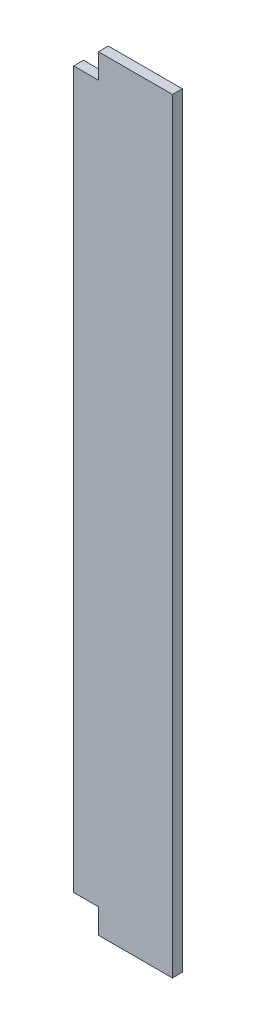
ISO-10303-21;
HEADER;
FILE_DESCRIPTION(('STEP AP214'),'2;1');
FILE_NAME('part.step','',(''),(''),'','','');
FILE_SCHEMA(('AUTOMOTIVE_DESIGN { 1 0 10303 214 1 1 1 1 }'));
ENDSEC;
DATA;
#1=APPLICATION_CONTEXT('core data for automotive mechanical design processes');
#2=APPLICATION_PROTOCOL_DEFINITION('international standard','automotive_design',2000,#1);
#3=PRODUCT_CONTEXT('',#1,'mechanical');
#4=PRODUCT('Part','Part','',(#3));
#5=PRODUCT_RELATED_PRODUCT_CATEGORY('part','',(#4));
#6=PRODUCT_DEFINITION_FORMATION('','',#4);
#7=PRODUCT_DEFINITION_CONTEXT('part definition',#1,'design');
#8=PRODUCT_DEFINITION('design','',#6,#7);
#9=PRODUCT_DEFINITION_SHAPE('','',#8);
#10=(LENGTH_UNIT() NAMED_UNIT(*) SI_UNIT(.MILLI.,.METRE.));
#11=(NAMED_UNIT(*) PLANE_ANGLE_UNIT() SI_UNIT($,.RADIAN.));
#12=(NAMED_UNIT(*) SI_UNIT($,.STERADIAN.) SOLID_ANGLE_UNIT());
#13=UNCERTAINTY_MEASURE_WITH_UNIT(LENGTH_MEASURE(1.E-05),#10,'distance_accuracy_value','');
#14=(GEOMETRIC_REPRESENTATION_CONTEXT(3) GLOBAL_UNCERTAINTY_ASSIGNED_CONTEXT((#13)) GLOBAL_UNIT_ASSIGNED_CONTEXT((#10,
#11,#12)) REPRESENTATION_CONTEXT('',''));
#15=CARTESIAN_POINT('',(0.,0.,0.));
#16=DIRECTION('',(0.,0.,1.));
#17=DIRECTION('',(1.,0.,0.));
#18=AXIS2_PLACEMENT_3D('',#15,#16,#17);
#19=CARTESIAN_POINT('',(-129.608938547486,1550.,-67.4581005586592));
#20=DIRECTION('',(1.,0.,0.));
#21=DIRECTION('',(0.,0.,-1.));
#22=AXIS2_PLACEMENT_3D('',#19,#20,#21);
#23=PLANE('',#22);
#24=DIRECTION('',(0.,-1.,0.));
#25=VECTOR('',#24,1.);
#26=CARTESIAN_POINT('',(-129.608938547486,1550.,-47.4581005586592));
#27=LINE('',#26,#25);
#28=CARTESIAN_POINT('',(-129.608938547486,1500.,-47.4581005586592));
#29=VERTEX_POINT('',#28);
#30=CARTESIAN_POINT('',(-129.608938547486,50.,-47.4581005586592));
#31=VERTEX_POINT('',#30);
#32=EDGE_CURVE('E11',#29,#31,#27,.T.);
#33=ORIENTED_EDGE('',*,*,#32,.F.);
#34=DIRECTION('',(0.,0.,1.));
#35=VECTOR('',#34,1.);
#36=CARTESIAN_POINT('',(-129.608938547486,1500.,-67.4581005586592));
#37=LINE('',#36,#35);
#38=CARTESIAN_POINT('',(-129.608938547486,1500.,-67.4581005586592));
#39=VERTEX_POINT('',#38);
#40=EDGE_CURVE('E102',#39,#29,#37,.T.);
#41=ORIENTED_EDGE('',*,*,#40,.F.);
#42=DIRECTION('',(0.,-1.,0.));
#43=VECTOR('',#42,1.);
#44=CARTESIAN_POINT('',(-129.608938547486,1550.,-67.4581005586592));
#45=LINE('',#44,#43);
#46=CARTESIAN_POINT('',(-129.608938547486,50.,-67.4581005586592));
#47=VERTEX_POINT('',#46);
#48=EDGE_CURVE('E117',#39,#47,#45,.T.);
#49=ORIENTED_EDGE('',*,*,#48,.T.);
#50=DIRECTION('',(0.,0.,1.));
#51=VECTOR('',#50,1.);
#52=CARTESIAN_POINT('',(-129.608938547486,50.,-67.4581005586592));
#53=LINE('',#52,#51);
#54=EDGE_CURVE('E159',#47,#31,#53,.T.);
#55=ORIENTED_EDGE('',*,*,#54,.T.);
#56=EDGE_LOOP('',(#33,#41,#49,#55));
#57=FACE_BOUND('',#56,.T.);
#58=ADVANCED_FACE('F33',(#57),#23,.F.);
#59=CARTESIAN_POINT('',(-129.608938547486,1550.,-47.4581005586592));
#60=DIRECTION('',(0.,0.,-1.));
#61=DIRECTION('',(-1.,0.,0.));
#62=AXIS2_PLACEMENT_3D('',#59,#60,#61);
#63=PLANE('',#62);
#64=DIRECTION('',(1.,0.,0.));
#65=VECTOR('',#64,1.);
#66=CARTESIAN_POINT('',(-129.608938547486,1550.,-47.4581005586592));
#67=LINE('',#66,#65);
#68=CARTESIAN_POINT('',(-79.6089385474861,1550.,-47.4581005586592));
#69=VERTEX_POINT('',#68);
#70=CARTESIAN_POINT('',(70.3910614525139,1550.,-47.4581005586592));
#71=VERTEX_POINT('',#70);
#72=EDGE_CURVE('E121',#69,#71,#67,.T.);
#73=ORIENTED_EDGE('',*,*,#72,.F.);
#74=DIRECTION('',(0.,1.,0.));
#75=VECTOR('',#74,1.);
#76=CARTESIAN_POINT('',(-79.6089385474861,1550.,-47.4581005586592));
#77=LINE('',#76,#75);
#78=CARTESIAN_POINT('',(-79.6089385474861,1500.,-47.4581005586592));
#79=VERTEX_POINT('',#78);
#80=EDGE_CURVE('E47',#79,#69,#77,.T.);
#81=ORIENTED_EDGE('',*,*,#80,.F.);
#82=DIRECTION('',(1.,0.,0.));
#83=VECTOR('',#82,1.);
#84=CARTESIAN_POINT('',(-79.6089385474861,1500.,-47.4581005586592));
#85=LINE('',#84,#83);
#86=EDGE_CURVE('E111',#29,#79,#85,.T.);
#87=ORIENTED_EDGE('',*,*,#86,.F.);
#88=ORIENTED_EDGE('',*,*,#32,.T.);
#89=DIRECTION('',(-1.,0.,0.));
#90=VECTOR('',#89,1.);
#91=CARTESIAN_POINT('',(-79.6089385474861,50.,-47.4581005586592));
#92=LINE('',#91,#90);
#93=CARTESIAN_POINT('',(-79.6089385474861,50.,-47.4581005586592));
#94=VERTEX_POINT('',#93);
#95=EDGE_CURVE('E146',#94,#31,#92,.T.);
#96=ORIENTED_EDGE('',*,*,#95,.F.);
#97=DIRECTION('',(0.,1.,0.));
#98=VECTOR('',#97,1.);
#99=CARTESIAN_POINT('',(-79.6089385474861,0.,-47.4581005586592));
#100=LINE('',#99,#98);
#101=CARTESIAN_POINT('',(-79.6089385474861,0.,-47.4581005586592));
#102=VERTEX_POINT('',#101);
#103=EDGE_CURVE('E151',#102,#94,#100,.T.);
#104=ORIENTED_EDGE('',*,*,#103,.F.);
#105=DIRECTION('',(1.,0.,0.));
#106=VECTOR('',#105,1.);
#107=CARTESIAN_POINT('',(-129.608938547486,0.,-47.4581005586592));
#108=LINE('',#107,#106);
#109=CARTESIAN_POINT('',(70.3910614525139,0.,-47.4581005586592));
#110=VERTEX_POINT('',#109);
#111=EDGE_CURVE('E125',#102,#110,#108,.T.);
#112=ORIENTED_EDGE('',*,*,#111,.T.);
#113=DIRECTION('',(0.,-1.,0.));
#114=VECTOR('',#113,1.);
#115=CARTESIAN_POINT('',(70.3910614525139,1550.,-47.4581005586592));
#116=LINE('',#115,#114);
#117=EDGE_CURVE('E40',#71,#110,#116,.T.);
#118=ORIENTED_EDGE('',*,*,#117,.F.);
#119=EDGE_LOOP('',(#73,#81,#87,#88,#96,#104,#112,#118));
#120=FACE_BOUND('',#119,.T.);
#121=ADVANCED_FACE('F162',(#120),#63,.F.);
#122=CARTESIAN_POINT('',(70.3910614525139,1550.,-67.4581005586592));
#123=DIRECTION('',(-1.,0.,0.));
#124=DIRECTION('',(0.,0.,1.));
#125=AXIS2_PLACEMENT_3D('',#122,#123,#124);
#126=PLANE('',#125);
#127=DIRECTION('',(0.,0.,-1.));
#128=VECTOR('',#127,1.);
#129=CARTESIAN_POINT('',(70.3910614525139,0.,-67.4581005586592));
#130=LINE('',#129,#128);
#131=CARTESIAN_POINT('',(70.3910614525139,0.,-67.4581005586592));
#132=VERTEX_POINT('',#131);
#133=EDGE_CURVE('E127',#110,#132,#130,.T.);
#134=ORIENTED_EDGE('',*,*,#133,.T.);
#135=DIRECTION('',(0.,-1.,0.));
#136=VECTOR('',#135,1.);
#137=CARTESIAN_POINT('',(70.3910614525139,1550.,-67.4581005586592));
#138=LINE('',#137,#136);
#139=CARTESIAN_POINT('',(70.3910614525139,1550.,-67.4581005586592));
#140=VERTEX_POINT('',#139);
#141=EDGE_CURVE('E119',#140,#132,#138,.T.);
#142=ORIENTED_EDGE('',*,*,#141,.F.);
#143=DIRECTION('',(0.,0.,-1.));
#144=VECTOR('',#143,1.);
#145=CARTESIAN_POINT('',(70.3910614525139,1550.,-67.4581005586592));
#146=LINE('',#145,#144);
#147=EDGE_CURVE('E115',#71,#140,#146,.T.);
#148=ORIENTED_EDGE('',*,*,#147,.F.);
#149=ORIENTED_EDGE('',*,*,#117,.T.);
#150=EDGE_LOOP('',(#134,#142,#148,#149));
#151=FACE_BOUND('',#150,.T.);
#152=ADVANCED_FACE('F137',(#151),#126,.F.);
#153=CARTESIAN_POINT('',(-129.608938547486,1550.,-67.4581005586592));
#154=DIRECTION('',(0.,0.,1.));
#155=DIRECTION('',(1.,0.,0.));
#156=AXIS2_PLACEMENT_3D('',#153,#154,#155);
#157=PLANE('',#156);
#158=DIRECTION('',(1.,0.,0.));
#159=VECTOR('',#158,1.);
#160=CARTESIAN_POINT('',(-79.6089385474861,1500.,-67.4581005586592));
#161=LINE('',#160,#159);
#162=CARTESIAN_POINT('',(-79.6089385474861,1500.,-67.4581005586592));
#163=VERTEX_POINT('',#162);
#164=EDGE_CURVE('E103',#39,#163,#161,.T.);
#165=ORIENTED_EDGE('',*,*,#164,.T.);
#166=DIRECTION('',(0.,1.,0.));
#167=VECTOR('',#166,1.);
#168=CARTESIAN_POINT('',(-79.6089385474861,1550.,-67.4581005586592));
#169=LINE('',#168,#167);
#170=CARTESIAN_POINT('',(-79.6089385474861,1550.,-67.4581005586592));
#171=VERTEX_POINT('',#170);
#172=EDGE_CURVE('E97',#163,#171,#169,.T.);
#173=ORIENTED_EDGE('',*,*,#172,.T.);
#174=DIRECTION('',(-1.,0.,0.));
#175=VECTOR('',#174,1.);
#176=CARTESIAN_POINT('',(-129.608938547486,1550.,-67.4581005586592));
#177=LINE('',#176,#175);
#178=EDGE_CURVE('E109',#140,#171,#177,.T.);
#179=ORIENTED_EDGE('',*,*,#178,.F.);
#180=ORIENTED_EDGE('',*,*,#141,.T.);
#181=DIRECTION('',(-1.,0.,0.));
#182=VECTOR('',#181,1.);
#183=CARTESIAN_POINT('',(-129.608938547486,0.,-67.4581005586592));
#184=LINE('',#183,#182);
#185=CARTESIAN_POINT('',(-79.6089385474861,0.,-67.4581005586592));
#186=VERTEX_POINT('',#185);
#187=EDGE_CURVE('E130',#132,#186,#184,.T.);
#188=ORIENTED_EDGE('',*,*,#187,.T.);
#189=DIRECTION('',(0.,1.,0.));
#190=VECTOR('',#189,1.);
#191=CARTESIAN_POINT('',(-79.6089385474861,0.,-67.4581005586592));
#192=LINE('',#191,#190);
#193=CARTESIAN_POINT('',(-79.6089385474861,50.,-67.4581005586592));
#194=VERTEX_POINT('',#193);
#195=EDGE_CURVE('E55',#186,#194,#192,.T.);
#196=ORIENTED_EDGE('',*,*,#195,.T.);
#197=DIRECTION('',(-1.,0.,0.));
#198=VECTOR('',#197,1.);
#199=CARTESIAN_POINT('',(-79.6089385474861,50.,-67.4581005586592));
#200=LINE('',#199,#198);
#201=EDGE_CURVE('E145',#194,#47,#200,.T.);
#202=ORIENTED_EDGE('',*,*,#201,.T.);
#203=ORIENTED_EDGE('',*,*,#48,.F.);
#204=EDGE_LOOP('',(#165,#173,#179,#180,#188,#196,#202,#203));
#205=FACE_BOUND('',#204,.T.);
#206=ADVANCED_FACE('F107',(#205),#157,.F.);
#207=CARTESIAN_POINT('',(0.,1550.,0.));
#208=DIRECTION('',(0.,1.,0.));
#209=DIRECTION('',(0.,0.,1.));
#210=AXIS2_PLACEMENT_3D('',#207,#208,#209);
#211=PLANE('',#210);
#212=DIRECTION('',(0.,0.,1.));
#213=VECTOR('',#212,1.);
#214=CARTESIAN_POINT('',(-79.6089385474861,1550.,-67.4581005586592));
#215=LINE('',#214,#213);
#216=EDGE_CURVE('E94',#171,#69,#215,.T.);
#217=ORIENTED_EDGE('',*,*,#216,.T.);
#218=ORIENTED_EDGE('',*,*,#72,.T.);
#219=ORIENTED_EDGE('',*,*,#147,.T.);
#220=ORIENTED_EDGE('',*,*,#178,.T.);
#221=EDGE_LOOP('',(#217,#218,#219,#220));
#222=FACE_BOUND('',#221,.T.);
#223=ADVANCED_FACE('F113',(#222),#211,.T.);
#224=CARTESIAN_POINT('',(0.,0.,0.));
#225=DIRECTION('',(0.,1.,0.));
#226=DIRECTION('',(0.,0.,1.));
#227=AXIS2_PLACEMENT_3D('',#224,#225,#226);
#228=PLANE('',#227);
#229=ORIENTED_EDGE('',*,*,#111,.F.);
#230=DIRECTION('',(0.,0.,1.));
#231=VECTOR('',#230,1.);
#232=CARTESIAN_POINT('',(-79.6089385474861,0.,-67.4581005586592));
#233=LINE('',#232,#231);
#234=EDGE_CURVE('E128',#186,#102,#233,.T.);
#235=ORIENTED_EDGE('',*,*,#234,.F.);
#236=ORIENTED_EDGE('',*,*,#187,.F.);
#237=ORIENTED_EDGE('',*,*,#133,.F.);
#238=EDGE_LOOP('',(#229,#235,#236,#237));
#239=FACE_BOUND('',#238,.T.);
#240=ADVANCED_FACE('F142',(#239),#228,.F.);
#241=CARTESIAN_POINT('',(-79.6089385474861,0.,-67.4581005586592));
#242=DIRECTION('',(1.,0.,0.));
#243=DIRECTION('',(0.,0.,-1.));
#244=AXIS2_PLACEMENT_3D('',#241,#242,#243);
#245=PLANE('',#244);
#246=ORIENTED_EDGE('',*,*,#103,.T.);
#247=DIRECTION('',(0.,0.,1.));
#248=VECTOR('',#247,1.);
#249=CARTESIAN_POINT('',(-79.6089385474861,50.,-67.4581005586592));
#250=LINE('',#249,#248);
#251=EDGE_CURVE('E148',#194,#94,#250,.T.);
#252=ORIENTED_EDGE('',*,*,#251,.F.);
#253=ORIENTED_EDGE('',*,*,#195,.F.);
#254=ORIENTED_EDGE('',*,*,#234,.T.);
#255=EDGE_LOOP('',(#246,#252,#253,#254));
#256=FACE_BOUND('',#255,.T.);
#257=ADVANCED_FACE('F179',(#256),#245,.F.);
#258=CARTESIAN_POINT('',(-79.6089385474861,50.,-67.4581005586592));
#259=DIRECTION('',(0.,1.,0.));
#260=DIRECTION('',(0.,0.,1.));
#261=AXIS2_PLACEMENT_3D('',#258,#259,#260);
#262=PLANE('',#261);
#263=ORIENTED_EDGE('',*,*,#95,.T.);
#264=ORIENTED_EDGE('',*,*,#54,.F.);
#265=ORIENTED_EDGE('',*,*,#201,.F.);
#266=ORIENTED_EDGE('',*,*,#251,.T.);
#267=EDGE_LOOP('',(#263,#264,#265,#266));
#268=FACE_BOUND('',#267,.T.);
#269=ADVANCED_FACE('F178',(#268),#262,.F.);
#270=CARTESIAN_POINT('',(-79.6089385474861,1550.,-67.4581005586592));
#271=DIRECTION('',(1.,0.,0.));
#272=DIRECTION('',(0.,1.,0.));
#273=AXIS2_PLACEMENT_3D('',#270,#271,#272);
#274=PLANE('',#273);
#275=ORIENTED_EDGE('',*,*,#80,.T.);
#276=ORIENTED_EDGE('',*,*,#216,.F.);
#277=ORIENTED_EDGE('',*,*,#172,.F.);
#278=DIRECTION('',(0.,0.,1.));
#279=VECTOR('',#278,1.);
#280=CARTESIAN_POINT('',(-79.6089385474861,1500.,-67.4581005586592));
#281=LINE('',#280,#279);
#282=EDGE_CURVE('E156',#163,#79,#281,.T.);
#283=ORIENTED_EDGE('',*,*,#282,.T.);
#284=EDGE_LOOP('',(#275,#276,#277,#283));
#285=FACE_BOUND('',#284,.T.);
#286=ADVANCED_FACE('F96',(#285),#274,.F.);
#287=CARTESIAN_POINT('',(-79.6089385474861,1500.,-67.4581005586592));
#288=DIRECTION('',(0.,-1.,0.));
#289=DIRECTION('',(0.,0.,-1.));
#290=AXIS2_PLACEMENT_3D('',#287,#288,#289);
#291=PLANE('',#290);
#292=ORIENTED_EDGE('',*,*,#86,.T.);
#293=ORIENTED_EDGE('',*,*,#282,.F.);
#294=ORIENTED_EDGE('',*,*,#164,.F.);
#295=ORIENTED_EDGE('',*,*,#40,.T.);
#296=EDGE_LOOP('',(#292,#293,#294,#295));
#297=FACE_BOUND('',#296,.T.);
#298=ADVANCED_FACE('F172',(#297),#291,.F.);
#299=CLOSED_SHELL('',(#58,#121,#152,#206,#223,#240,#257,#269,#286,#298));
#300=MANIFOLD_SOLID_BREP('B2',#299);
#301=ADVANCED_BREP_SHAPE_REPRESENTATION('',(#18,#300),#14);
#302=SHAPE_DEFINITION_REPRESENTATION(#9,#301);
ENDSEC;
END-ISO-10303-21;
